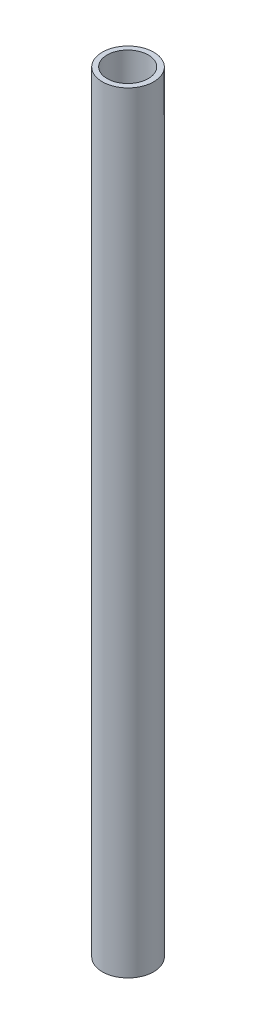
ISO-10303-21;
HEADER;
FILE_DESCRIPTION(('STEP AP214'),'2;1');
FILE_NAME('part.step','',(''),(''),'','','');
FILE_SCHEMA(('AUTOMOTIVE_DESIGN { 1 0 10303 214 1 1 1 1 }'));
ENDSEC;
DATA;
#1=APPLICATION_CONTEXT('core data for automotive mechanical design processes');
#2=APPLICATION_PROTOCOL_DEFINITION('international standard','automotive_design',2000,#1);
#3=PRODUCT_CONTEXT('',#1,'mechanical');
#4=PRODUCT('Part','Part','',(#3));
#5=PRODUCT_RELATED_PRODUCT_CATEGORY('part','',(#4));
#6=PRODUCT_DEFINITION_FORMATION('','',#4);
#7=PRODUCT_DEFINITION_CONTEXT('part definition',#1,'design');
#8=PRODUCT_DEFINITION('design','',#6,#7);
#9=PRODUCT_DEFINITION_SHAPE('','',#8);
#10=(LENGTH_UNIT() NAMED_UNIT(*) SI_UNIT(.MILLI.,.METRE.));
#11=(NAMED_UNIT(*) PLANE_ANGLE_UNIT() SI_UNIT($,.RADIAN.));
#12=(NAMED_UNIT(*) SI_UNIT($,.STERADIAN.) SOLID_ANGLE_UNIT());
#13=UNCERTAINTY_MEASURE_WITH_UNIT(LENGTH_MEASURE(1.E-05),#10,'distance_accuracy_value','');
#14=(GEOMETRIC_REPRESENTATION_CONTEXT(3) GLOBAL_UNCERTAINTY_ASSIGNED_CONTEXT((#13)) GLOBAL_UNIT_ASSIGNED_CONTEXT((#10,
#11,#12)) REPRESENTATION_CONTEXT('',''));
#15=CARTESIAN_POINT('',(0.,0.,0.));
#16=DIRECTION('',(0.,0.,1.));
#17=DIRECTION('',(1.,0.,0.));
#18=AXIS2_PLACEMENT_3D('',#15,#16,#17);
#19=CARTESIAN_POINT('',(0.,0.,0.));
#20=DIRECTION('',(0.,-1.,0.));
#21=DIRECTION('',(0.,0.,-1.));
#22=AXIS2_PLACEMENT_3D('',#19,#20,#21);
#23=CYLINDRICAL_SURFACE('',#22,5.);
#24=CARTESIAN_POINT('',(0.,150.,0.));
#25=DIRECTION('',(0.,-1.,0.));
#26=DIRECTION('',(0.,0.,-1.));
#27=AXIS2_PLACEMENT_3D('',#24,#25,#26);
#28=CIRCLE('',#27,5.);
#29=CARTESIAN_POINT('',(0.,150.,-5.));
#30=VERTEX_POINT('',#29);
#31=EDGE_CURVE('E10',#30,#30,#28,.T.);
#32=ORIENTED_EDGE('',*,*,#31,.T.);
#33=EDGE_LOOP('',(#32));
#34=FACE_BOUND('',#33,.T.);
#35=CARTESIAN_POINT('',(0.,0.,0.));
#36=DIRECTION('',(0.,-1.,0.));
#37=DIRECTION('',(0.,0.,-1.));
#38=AXIS2_PLACEMENT_3D('',#35,#36,#37);
#39=CIRCLE('',#38,5.);
#40=CARTESIAN_POINT('',(0.,0.,-5.));
#41=VERTEX_POINT('',#40);
#42=EDGE_CURVE('E51',#41,#41,#39,.T.);
#43=ORIENTED_EDGE('',*,*,#42,.F.);
#44=EDGE_LOOP('',(#43));
#45=FACE_BOUND('',#44,.T.);
#46=ADVANCED_FACE('F43',(#34,#45),#23,.T.);
#47=CARTESIAN_POINT('',(0.,150.,0.));
#48=DIRECTION('',(0.,1.,0.));
#49=DIRECTION('',(0.,0.,1.));
#50=AXIS2_PLACEMENT_3D('',#47,#48,#49);
#51=PLANE('',#50);
#52=CARTESIAN_POINT('',(-0.0624999267573703,150.,0.));
#53=DIRECTION('',(0.,1.,0.));
#54=DIRECTION('',(1.,0.,0.));
#55=AXIS2_PLACEMENT_3D('',#52,#53,#54);
#56=ELLIPSE('',#55,4.00001249999023,4.);
#57=CARTESIAN_POINT('',(3.93751257323286,150.,0.));
#58=VERTEX_POINT('',#57);
#59=EDGE_CURVE('E56',#58,#58,#56,.T.);
#60=ORIENTED_EDGE('',*,*,#59,.F.);
#61=EDGE_LOOP('',(#60));
#62=FACE_BOUND('',#61,.T.);
#63=ORIENTED_EDGE('',*,*,#31,.F.);
#64=EDGE_LOOP('',(#63));
#65=FACE_BOUND('',#64,.T.);
#66=ADVANCED_FACE('F72',(#62,#65),#51,.T.);
#67=CARTESIAN_POINT('',(0.,0.,0.));
#68=DIRECTION('',(0.,-1.,0.));
#69=DIRECTION('',(0.,0.,-1.));
#70=AXIS2_PLACEMENT_3D('',#67,#68,#69);
#71=PLANE('',#70);
#72=CARTESIAN_POINT('',(-0.437500073243349,0.,0.));
#73=DIRECTION('',(0.,-1.,0.));
#74=DIRECTION('',(1.,0.,0.));
#75=AXIS2_PLACEMENT_3D('',#72,#73,#74);
#76=ELLIPSE('',#75,4.00001249999023,4.);
#77=CARTESIAN_POINT('',(3.56251242674689,0.,0.));
#78=VERTEX_POINT('',#77);
#79=EDGE_CURVE('E46',#78,#78,#76,.T.);
#80=ORIENTED_EDGE('',*,*,#79,.F.);
#81=EDGE_LOOP('',(#80));
#82=FACE_BOUND('',#81,.T.);
#83=ORIENTED_EDGE('',*,*,#42,.T.);
#84=EDGE_LOOP('',(#83));
#85=FACE_BOUND('',#84,.T.);
#86=ADVANCED_FACE('F69',(#82,#85),#71,.T.);
#87=CARTESIAN_POINT('',(-0.437528588711947,-0.0114061829837864,0.));
#88=DIRECTION('',(0.00249999316410066,0.999996875012207,0.));
#89=DIRECTION('',(-0.999996875012207,0.00249999316410066,0.));
#90=AXIS2_PLACEMENT_3D('',#87,#88,#89);
#91=CYLINDRICAL_SURFACE('',#90,4.);
#92=ORIENTED_EDGE('',*,*,#59,.T.);
#93=EDGE_LOOP('',(#92));
#94=FACE_BOUND('',#93,.T.);
#95=ORIENTED_EDGE('',*,*,#79,.T.);
#96=EDGE_LOOP('',(#95));
#97=FACE_BOUND('',#96,.T.);
#98=ADVANCED_FACE('F67',(#94,#97),#91,.F.);
#99=CLOSED_SHELL('',(#46,#66,#86,#98));
#100=MANIFOLD_SOLID_BREP('B2',#99);
#101=ADVANCED_BREP_SHAPE_REPRESENTATION('',(#18,#100),#14);
#102=SHAPE_DEFINITION_REPRESENTATION(#9,#101);
ENDSEC;
END-ISO-10303-21;
